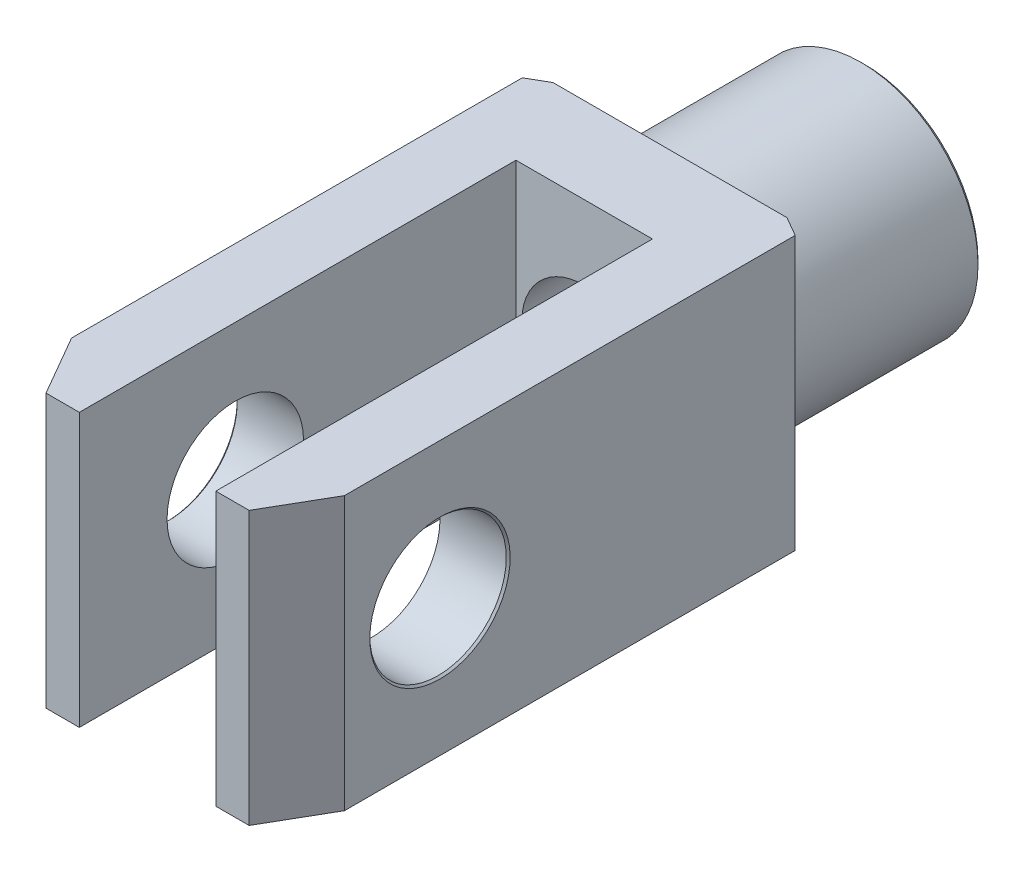
ISO-10303-21;
HEADER;
FILE_DESCRIPTION(('STEP AP214'),'2;1');
FILE_NAME('part.step','',(''),(''),'','','');
FILE_SCHEMA(('AUTOMOTIVE_DESIGN { 1 0 10303 214 1 1 1 1 }'));
ENDSEC;
DATA;
#1=APPLICATION_CONTEXT('core data for automotive mechanical design processes');
#2=APPLICATION_PROTOCOL_DEFINITION('international standard','automotive_design',2000,#1);
#3=PRODUCT_CONTEXT('',#1,'mechanical');
#4=PRODUCT('Part','Part','',(#3));
#5=PRODUCT_RELATED_PRODUCT_CATEGORY('part','',(#4));
#6=PRODUCT_DEFINITION_FORMATION('','',#4);
#7=PRODUCT_DEFINITION_CONTEXT('part definition',#1,'design');
#8=PRODUCT_DEFINITION('design','',#6,#7);
#9=PRODUCT_DEFINITION_SHAPE('','',#8);
#10=(LENGTH_UNIT() NAMED_UNIT(*) SI_UNIT(.MILLI.,.METRE.));
#11=(NAMED_UNIT(*) PLANE_ANGLE_UNIT() SI_UNIT($,.RADIAN.));
#12=(NAMED_UNIT(*) SI_UNIT($,.STERADIAN.) SOLID_ANGLE_UNIT());
#13=UNCERTAINTY_MEASURE_WITH_UNIT(LENGTH_MEASURE(1.E-05),#10,'distance_accuracy_value','');
#14=(GEOMETRIC_REPRESENTATION_CONTEXT(3) GLOBAL_UNCERTAINTY_ASSIGNED_CONTEXT((#13)) GLOBAL_UNIT_ASSIGNED_CONTEXT((#10,
#11,#12)) REPRESENTATION_CONTEXT('',''));
#15=CARTESIAN_POINT('',(0.,0.,0.));
#16=DIRECTION('',(0.,0.,1.));
#17=DIRECTION('',(1.,0.,0.));
#18=AXIS2_PLACEMENT_3D('',#15,#16,#17);
#19=CARTESIAN_POINT('',(0.,0.,50.));
#20=DIRECTION('',(0.,0.,1.));
#21=DIRECTION('',(1.,0.,0.));
#22=AXIS2_PLACEMENT_3D('',#19,#20,#21);
#23=PLANE('',#22);
#24=DIRECTION('',(1.,0.,0.));
#25=VECTOR('',#24,1.);
#26=CARTESIAN_POINT('',(-35.,-35.,50.));
#27=LINE('',#26,#25);
#28=CARTESIAN_POINT('',(-30.,-35.,50.));
#29=VERTEX_POINT('',#28);
#30=CARTESIAN_POINT('',(29.9999999999999,-35.,50.));
#31=VERTEX_POINT('',#30);
#32=EDGE_CURVE('E173',#29,#31,#27,.T.);
#33=ORIENTED_EDGE('',*,*,#32,.F.);
#34=DIRECTION('',(0.,1.,0.));
#35=VECTOR('',#34,1.);
#36=CARTESIAN_POINT('',(-30.,0.,50.));
#37=LINE('',#36,#35);
#38=CARTESIAN_POINT('',(-30.,0.,50.));
#39=VERTEX_POINT('',#38);
#40=EDGE_CURVE('E60',#29,#39,#37,.T.);
#41=ORIENTED_EDGE('',*,*,#40,.T.);
#42=CARTESIAN_POINT('',(0.,0.,50.));
#43=DIRECTION('',(0.,0.,1.));
#44=DIRECTION('',(1.,0.,0.));
#45=AXIS2_PLACEMENT_3D('',#42,#43,#44);
#46=CIRCLE('',#45,30.);
#47=CARTESIAN_POINT('',(30.,0.,50.));
#48=VERTEX_POINT('',#47);
#49=EDGE_CURVE('E200',#39,#48,#46,.T.);
#50=ORIENTED_EDGE('',*,*,#49,.T.);
#51=DIRECTION('',(0.,-1.,0.));
#52=VECTOR('',#51,1.);
#53=CARTESIAN_POINT('',(30.,0.,50.));
#54=LINE('',#53,#52);
#55=EDGE_CURVE('E257',#48,#31,#54,.T.);
#56=ORIENTED_EDGE('',*,*,#55,.T.);
#57=EDGE_LOOP('',(#33,#41,#50,#56));
#58=FACE_BOUND('',#57,.T.);
#59=ADVANCED_FACE('F38',(#58),#23,.F.);
#60=CARTESIAN_POINT('',(0.,0.,184.));
#61=DIRECTION('',(0.,0.,1.));
#62=DIRECTION('',(1.,0.,0.));
#63=AXIS2_PLACEMENT_3D('',#60,#61,#62);
#64=PLANE('',#63);
#65=DIRECTION('',(-1.,0.,0.));
#66=VECTOR('',#65,1.);
#67=CARTESIAN_POINT('',(-35.,35.,184.));
#68=LINE('',#67,#66);
#69=CARTESIAN_POINT('',(-17.5,35.,184.));
#70=VERTEX_POINT('',#69);
#71=CARTESIAN_POINT('',(-26.0510708275608,35.,184.));
#72=VERTEX_POINT('',#71);
#73=EDGE_CURVE('E180',#70,#72,#68,.T.);
#74=ORIENTED_EDGE('',*,*,#73,.T.);
#75=DIRECTION('',(0.,-1.,0.));
#76=VECTOR('',#75,1.);
#77=CARTESIAN_POINT('',(-26.0510708275608,-35.,184.));
#78=LINE('',#77,#76);
#79=CARTESIAN_POINT('',(-26.0510708275608,-35.,184.));
#80=VERTEX_POINT('',#79);
#81=EDGE_CURVE('E217',#72,#80,#78,.T.);
#82=ORIENTED_EDGE('',*,*,#81,.T.);
#83=DIRECTION('',(1.,0.,0.));
#84=VECTOR('',#83,1.);
#85=CARTESIAN_POINT('',(-35.,-35.,184.));
#86=LINE('',#85,#84);
#87=CARTESIAN_POINT('',(-17.5,-35.,184.));
#88=VERTEX_POINT('',#87);
#89=EDGE_CURVE('E178',#80,#88,#86,.T.);
#90=ORIENTED_EDGE('',*,*,#89,.T.);
#91=DIRECTION('',(0.,-1.,0.));
#92=VECTOR('',#91,1.);
#93=CARTESIAN_POINT('',(-17.5,35.,184.));
#94=LINE('',#93,#92);
#95=EDGE_CURVE('E141',#70,#88,#94,.T.);
#96=ORIENTED_EDGE('',*,*,#95,.F.);
#97=EDGE_LOOP('',(#74,#82,#90,#96));
#98=FACE_BOUND('',#97,.T.);
#99=ADVANCED_FACE('F300',(#98),#64,.T.);
#100=CARTESIAN_POINT('',(0.,0.,50.));
#101=DIRECTION('',(0.,0.,-1.));
#102=DIRECTION('',(-1.,0.,0.));
#103=AXIS2_PLACEMENT_3D('',#100,#101,#102);
#104=CYLINDRICAL_SURFACE('',#103,30.);
#105=CARTESIAN_POINT('',(0.,0.,1.00000000000003));
#106=DIRECTION('',(0.,0.,1.));
#107=DIRECTION('',(1.,0.,0.));
#108=AXIS2_PLACEMENT_3D('',#105,#106,#107);
#109=CIRCLE('',#108,30.);
#110=CARTESIAN_POINT('',(30.,0.,1.00000000000003));
#111=VERTEX_POINT('',#110);
#112=EDGE_CURVE('E238',#111,#111,#109,.T.);
#113=ORIENTED_EDGE('',*,*,#112,.T.);
#114=EDGE_LOOP('',(#113));
#115=FACE_BOUND('',#114,.T.);
#116=EDGE_CURVE('E201',#48,#39,#46,.T.);
#117=ORIENTED_EDGE('',*,*,#116,.F.);
#118=ORIENTED_EDGE('',*,*,#49,.F.);
#119=EDGE_LOOP('',(#117,#118));
#120=FACE_BOUND('',#119,.T.);
#121=ADVANCED_FACE('F323',(#115,#120),#104,.T.);
#122=CARTESIAN_POINT('',(0.,0.,0.));
#123=DIRECTION('',(0.,0.,1.));
#124=DIRECTION('',(1.,0.,0.));
#125=AXIS2_PLACEMENT_3D('',#122,#123,#124);
#126=PLANE('',#125);
#127=CARTESIAN_POINT('',(0.,0.,0.));
#128=DIRECTION('',(0.,0.,1.));
#129=DIRECTION('',(1.,0.,0.));
#130=AXIS2_PLACEMENT_3D('',#127,#128,#129);
#131=CIRCLE('',#130,18.);
#132=CARTESIAN_POINT('',(18.,0.,0.));
#133=VERTEX_POINT('',#132);
#134=EDGE_CURVE('E247',#133,#133,#131,.T.);
#135=ORIENTED_EDGE('',*,*,#134,.T.);
#136=EDGE_LOOP('',(#135));
#137=FACE_BOUND('',#136,.T.);
#138=CARTESIAN_POINT('',(0.,0.,0.));
#139=DIRECTION('',(0.,0.,1.));
#140=DIRECTION('',(1.,0.,0.));
#141=AXIS2_PLACEMENT_3D('',#138,#139,#140);
#142=CIRCLE('',#141,28.9999999999999);
#143=CARTESIAN_POINT('',(28.9999999999999,0.,0.));
#144=VERTEX_POINT('',#143);
#145=EDGE_CURVE('E241',#144,#144,#142,.F.);
#146=ORIENTED_EDGE('',*,*,#145,.T.);
#147=EDGE_LOOP('',(#146));
#148=FACE_BOUND('',#147,.T.);
#149=ADVANCED_FACE('F327',(#137,#148),#126,.F.);
#150=ORIENTED_EDGE('',*,*,#116,.T.);
#151=DIRECTION('',(0.,1.,0.));
#152=VECTOR('',#151,1.);
#153=CARTESIAN_POINT('',(-30.,0.,50.));
#154=LINE('',#153,#152);
#155=CARTESIAN_POINT('',(-30.,35.,50.));
#156=VERTEX_POINT('',#155);
#157=EDGE_CURVE('E261',#39,#156,#154,.T.);
#158=ORIENTED_EDGE('',*,*,#157,.T.);
#159=DIRECTION('',(-1.,0.,0.));
#160=VECTOR('',#159,1.);
#161=CARTESIAN_POINT('',(-35.,35.,50.));
#162=LINE('',#161,#160);
#163=CARTESIAN_POINT('',(30.,35.,50.));
#164=VERTEX_POINT('',#163);
#165=EDGE_CURVE('E187',#164,#156,#162,.T.);
#166=ORIENTED_EDGE('',*,*,#165,.F.);
#167=DIRECTION('',(0.,-1.,0.));
#168=VECTOR('',#167,1.);
#169=CARTESIAN_POINT('',(30.,0.,50.));
#170=LINE('',#169,#168);
#171=EDGE_CURVE('E259',#164,#48,#170,.T.);
#172=ORIENTED_EDGE('',*,*,#171,.T.);
#173=EDGE_LOOP('',(#150,#158,#166,#172));
#174=FACE_BOUND('',#173,.T.);
#175=ADVANCED_FACE('F319',(#174),#23,.F.);
#176=CARTESIAN_POINT('',(-35.,35.,184.));
#177=DIRECTION('',(1.,0.,0.));
#178=DIRECTION('',(0.,1.,0.));
#179=AXIS2_PLACEMENT_3D('',#176,#177,#178);
#180=PLANE('',#179);
#181=CARTESIAN_POINT('',(-35.,0.,144.));
#182=DIRECTION('',(1.,0.,0.));
#183=DIRECTION('',(0.,1.,0.));
#184=AXIS2_PLACEMENT_3D('',#181,#182,#183);
#185=CIRCLE('',#184,18.);
#186=CARTESIAN_POINT('',(-35.,18.,144.));
#187=VERTEX_POINT('',#186);
#188=EDGE_CURVE('E222',#187,#187,#185,.T.);
#189=ORIENTED_EDGE('',*,*,#188,.T.);
#190=EDGE_LOOP('',(#189));
#191=FACE_BOUND('',#190,.T.);
#192=DIRECTION('',(0.,0.,-1.));
#193=VECTOR('',#192,1.);
#194=CARTESIAN_POINT('',(-35.,35.,184.));
#195=LINE('',#194,#193);
#196=CARTESIAN_POINT('',(-35.,35.,168.5));
#197=VERTEX_POINT('',#196);
#198=CARTESIAN_POINT('',(-35.,35.,52.8867513459481));
#199=VERTEX_POINT('',#198);
#200=EDGE_CURVE('E184',#197,#199,#195,.T.);
#201=ORIENTED_EDGE('',*,*,#200,.T.);
#202=DIRECTION('',(0.,-1.,0.));
#203=VECTOR('',#202,1.);
#204=CARTESIAN_POINT('',(-35.,35.,52.8867513459481));
#205=LINE('',#204,#203);
#206=CARTESIAN_POINT('',(-35.,-35.,52.8867513459481));
#207=VERTEX_POINT('',#206);
#208=EDGE_CURVE('E250',#199,#207,#205,.T.);
#209=ORIENTED_EDGE('',*,*,#208,.T.);
#210=DIRECTION('',(0.,0.,-1.));
#211=VECTOR('',#210,1.);
#212=CARTESIAN_POINT('',(-35.,-35.,184.));
#213=LINE('',#212,#211);
#214=CARTESIAN_POINT('',(-35.,-35.,168.5));
#215=VERTEX_POINT('',#214);
#216=EDGE_CURVE('E198',#215,#207,#213,.T.);
#217=ORIENTED_EDGE('',*,*,#216,.F.);
#218=DIRECTION('',(0.,1.,0.));
#219=VECTOR('',#218,1.);
#220=CARTESIAN_POINT('',(-35.,35.,168.5));
#221=LINE('',#220,#219);
#222=EDGE_CURVE('E220',#215,#197,#221,.T.);
#223=ORIENTED_EDGE('',*,*,#222,.T.);
#224=EDGE_LOOP('',(#201,#209,#217,#223));
#225=FACE_BOUND('',#224,.T.);
#226=ADVANCED_FACE('F274',(#191,#225),#180,.F.);
#227=CARTESIAN_POINT('',(-35.,-35.,184.));
#228=DIRECTION('',(0.,1.,0.));
#229=DIRECTION('',(0.,0.,1.));
#230=AXIS2_PLACEMENT_3D('',#227,#228,#229);
#231=PLANE('',#230);
#232=ORIENTED_EDGE('',*,*,#216,.T.);
#233=DIRECTION('',(-0.866025403784441,0.,0.499999999999995));
#234=VECTOR('',#233,1.);
#235=CARTESIAN_POINT('',(-35.,-35.,52.8867513459481));
#236=LINE('',#235,#234);
#237=EDGE_CURVE('E255',#207,#29,#236,.F.);
#238=ORIENTED_EDGE('',*,*,#237,.T.);
#239=ORIENTED_EDGE('',*,*,#32,.T.);
#240=DIRECTION('',(-0.866025403784441,0.,-0.499999999999995));
#241=VECTOR('',#240,1.);
#242=CARTESIAN_POINT('',(35.,-35.,52.8867513459481));
#243=LINE('',#242,#241);
#244=CARTESIAN_POINT('',(35.,-35.,52.8867513459481));
#245=VERTEX_POINT('',#244);
#246=EDGE_CURVE('E253',#31,#245,#243,.F.);
#247=ORIENTED_EDGE('',*,*,#246,.T.);
#248=DIRECTION('',(0.,0.,-1.));
#249=VECTOR('',#248,1.);
#250=CARTESIAN_POINT('',(35.,-35.,184.));
#251=LINE('',#250,#249);
#252=CARTESIAN_POINT('',(35.,-35.,168.5));
#253=VERTEX_POINT('',#252);
#254=EDGE_CURVE('E195',#253,#245,#251,.T.);
#255=ORIENTED_EDGE('',*,*,#254,.F.);
#256=DIRECTION('',(-0.499999999999998,0.,0.86602540378444));
#257=VECTOR('',#256,1.);
#258=CARTESIAN_POINT('',(26.0510708275608,-35.,184.));
#259=LINE('',#258,#257);
#260=CARTESIAN_POINT('',(26.0510708275608,-35.,184.));
#261=VERTEX_POINT('',#260);
#262=EDGE_CURVE('E215',#253,#261,#259,.T.);
#263=ORIENTED_EDGE('',*,*,#262,.T.);
#264=CARTESIAN_POINT('',(17.5,-35.,184.));
#265=VERTEX_POINT('',#264);
#266=EDGE_CURVE('E181',#265,#261,#86,.T.);
#267=ORIENTED_EDGE('',*,*,#266,.F.);
#268=DIRECTION('',(0.,0.,1.));
#269=VECTOR('',#268,1.);
#270=CARTESIAN_POINT('',(17.5,-35.,72.));
#271=LINE('',#270,#269);
#272=CARTESIAN_POINT('',(17.5,-35.,72.));
#273=VERTEX_POINT('',#272);
#274=EDGE_CURVE('E145',#273,#265,#271,.T.);
#275=ORIENTED_EDGE('',*,*,#274,.F.);
#276=DIRECTION('',(1.,0.,0.));
#277=VECTOR('',#276,1.);
#278=CARTESIAN_POINT('',(-17.5,-35.,72.));
#279=LINE('',#278,#277);
#280=CARTESIAN_POINT('',(-17.5,-35.,72.));
#281=VERTEX_POINT('',#280);
#282=EDGE_CURVE('E152',#281,#273,#279,.T.);
#283=ORIENTED_EDGE('',*,*,#282,.F.);
#284=DIRECTION('',(0.,0.,1.));
#285=VECTOR('',#284,1.);
#286=CARTESIAN_POINT('',(-17.5,-35.,72.));
#287=LINE('',#286,#285);
#288=EDGE_CURVE('E135',#281,#88,#287,.T.);
#289=ORIENTED_EDGE('',*,*,#288,.T.);
#290=ORIENTED_EDGE('',*,*,#89,.F.);
#291=DIRECTION('',(-0.499999999999998,0.,-0.86602540378444));
#292=VECTOR('',#291,1.);
#293=CARTESIAN_POINT('',(-26.0510708275608,-35.,184.));
#294=LINE('',#293,#292);
#295=EDGE_CURVE('E213',#80,#215,#294,.T.);
#296=ORIENTED_EDGE('',*,*,#295,.T.);
#297=EDGE_LOOP('',(#232,#238,#239,#247,#255,#263,#267,#275,#283,#289,#290,#296));
#298=FACE_BOUND('',#297,.T.);
#299=ADVANCED_FACE('F159',(#298),#231,.F.);
#300=CARTESIAN_POINT('',(35.,35.,184.));
#301=DIRECTION('',(-1.,0.,0.));
#302=DIRECTION('',(0.,-1.,0.));
#303=AXIS2_PLACEMENT_3D('',#300,#301,#302);
#304=PLANE('',#303);
#305=CARTESIAN_POINT('',(35.,0.,144.));
#306=DIRECTION('',(-1.,0.,0.));
#307=DIRECTION('',(0.,-1.,0.));
#308=AXIS2_PLACEMENT_3D('',#305,#306,#307);
#309=CIRCLE('',#308,18.0000000000001);
#310=CARTESIAN_POINT('',(35.,-18.0000000000001,144.));
#311=VERTEX_POINT('',#310);
#312=EDGE_CURVE('E235',#311,#311,#309,.T.);
#313=ORIENTED_EDGE('',*,*,#312,.T.);
#314=EDGE_LOOP('',(#313));
#315=FACE_BOUND('',#314,.T.);
#316=ORIENTED_EDGE('',*,*,#254,.T.);
#317=DIRECTION('',(0.,1.,0.));
#318=VECTOR('',#317,1.);
#319=CARTESIAN_POINT('',(35.,35.,52.8867513459481));
#320=LINE('',#319,#318);
#321=CARTESIAN_POINT('',(35.,35.,52.8867513459481));
#322=VERTEX_POINT('',#321);
#323=EDGE_CURVE('E11',#245,#322,#320,.T.);
#324=ORIENTED_EDGE('',*,*,#323,.T.);
#325=DIRECTION('',(0.,0.,-1.));
#326=VECTOR('',#325,1.);
#327=CARTESIAN_POINT('',(35.,35.,184.));
#328=LINE('',#327,#326);
#329=CARTESIAN_POINT('',(35.,35.,168.5));
#330=VERTEX_POINT('',#329);
#331=EDGE_CURVE('E192',#330,#322,#328,.T.);
#332=ORIENTED_EDGE('',*,*,#331,.F.);
#333=DIRECTION('',(0.,-1.,0.));
#334=VECTOR('',#333,1.);
#335=CARTESIAN_POINT('',(35.,-35.,168.5));
#336=LINE('',#335,#334);
#337=EDGE_CURVE('E211',#330,#253,#336,.T.);
#338=ORIENTED_EDGE('',*,*,#337,.T.);
#339=EDGE_LOOP('',(#316,#324,#332,#338));
#340=FACE_BOUND('',#339,.T.);
#341=ADVANCED_FACE('F284',(#315,#340),#304,.F.);
#342=CARTESIAN_POINT('',(-35.,35.,184.));
#343=DIRECTION('',(0.,-1.,0.));
#344=DIRECTION('',(0.,0.,-1.));
#345=AXIS2_PLACEMENT_3D('',#342,#343,#344);
#346=PLANE('',#345);
#347=ORIENTED_EDGE('',*,*,#165,.T.);
#348=DIRECTION('',(0.866025403784441,0.,-0.499999999999995));
#349=VECTOR('',#348,1.);
#350=CARTESIAN_POINT('',(-35.,35.,52.8867513459481));
#351=LINE('',#350,#349);
#352=EDGE_CURVE('E46',#156,#199,#351,.F.);
#353=ORIENTED_EDGE('',*,*,#352,.T.);
#354=ORIENTED_EDGE('',*,*,#200,.F.);
#355=DIRECTION('',(0.499999999999998,0.,0.86602540378444));
#356=VECTOR('',#355,1.);
#357=CARTESIAN_POINT('',(-26.0510708275608,35.,184.));
#358=LINE('',#357,#356);
#359=EDGE_CURVE('E207',#197,#72,#358,.T.);
#360=ORIENTED_EDGE('',*,*,#359,.T.);
#361=ORIENTED_EDGE('',*,*,#73,.F.);
#362=DIRECTION('',(0.,0.,1.));
#363=VECTOR('',#362,1.);
#364=CARTESIAN_POINT('',(-17.5,35.,72.));
#365=LINE('',#364,#363);
#366=CARTESIAN_POINT('',(-17.5,35.,72.));
#367=VERTEX_POINT('',#366);
#368=EDGE_CURVE('E171',#367,#70,#365,.T.);
#369=ORIENTED_EDGE('',*,*,#368,.F.);
#370=DIRECTION('',(-1.,0.,0.));
#371=VECTOR('',#370,1.);
#372=CARTESIAN_POINT('',(-17.5,35.,72.));
#373=LINE('',#372,#371);
#374=CARTESIAN_POINT('',(17.5,35.,72.));
#375=VERTEX_POINT('',#374);
#376=EDGE_CURVE('E146',#375,#367,#373,.T.);
#377=ORIENTED_EDGE('',*,*,#376,.F.);
#378=DIRECTION('',(0.,0.,1.));
#379=VECTOR('',#378,1.);
#380=CARTESIAN_POINT('',(17.5,35.,72.));
#381=LINE('',#380,#379);
#382=CARTESIAN_POINT('',(17.5,35.,184.));
#383=VERTEX_POINT('',#382);
#384=EDGE_CURVE('E174',#375,#383,#381,.T.);
#385=ORIENTED_EDGE('',*,*,#384,.T.);
#386=CARTESIAN_POINT('',(26.0510708275608,35.,184.));
#387=VERTEX_POINT('',#386);
#388=EDGE_CURVE('E182',#387,#383,#68,.T.);
#389=ORIENTED_EDGE('',*,*,#388,.F.);
#390=DIRECTION('',(0.499999999999998,0.,-0.86602540378444));
#391=VECTOR('',#390,1.);
#392=CARTESIAN_POINT('',(26.0510708275608,35.,184.));
#393=LINE('',#392,#391);
#394=EDGE_CURVE('E209',#387,#330,#393,.T.);
#395=ORIENTED_EDGE('',*,*,#394,.T.);
#396=ORIENTED_EDGE('',*,*,#331,.T.);
#397=DIRECTION('',(0.866025403784441,0.,0.499999999999995));
#398=VECTOR('',#397,1.);
#399=CARTESIAN_POINT('',(35.,35.,52.8867513459481));
#400=LINE('',#399,#398);
#401=EDGE_CURVE('E53',#322,#164,#400,.F.);
#402=ORIENTED_EDGE('',*,*,#401,.T.);
#403=EDGE_LOOP('',(#347,#353,#354,#360,#361,#369,#377,#385,#389,#395,#396,#402));
#404=FACE_BOUND('',#403,.T.);
#405=ADVANCED_FACE('F267',(#404),#346,.F.);
#406=ORIENTED_EDGE('',*,*,#266,.T.);
#407=DIRECTION('',(0.,1.,0.));
#408=VECTOR('',#407,1.);
#409=CARTESIAN_POINT('',(26.0510708275608,35.,184.));
#410=LINE('',#409,#408);
#411=EDGE_CURVE('E204',#261,#387,#410,.T.);
#412=ORIENTED_EDGE('',*,*,#411,.T.);
#413=ORIENTED_EDGE('',*,*,#388,.T.);
#414=DIRECTION('',(0.,1.,0.));
#415=VECTOR('',#414,1.);
#416=CARTESIAN_POINT('',(17.5,35.,184.));
#417=LINE('',#416,#415);
#418=EDGE_CURVE('E156',#265,#383,#417,.T.);
#419=ORIENTED_EDGE('',*,*,#418,.F.);
#420=EDGE_LOOP('',(#406,#412,#413,#419));
#421=FACE_BOUND('',#420,.T.);
#422=ADVANCED_FACE('F293',(#421),#64,.T.);
#423=CARTESIAN_POINT('',(-17.5,35.,72.));
#424=DIRECTION('',(-1.,0.,0.));
#425=DIRECTION('',(0.,-1.,0.));
#426=AXIS2_PLACEMENT_3D('',#423,#424,#425);
#427=PLANE('',#426);
#428=CARTESIAN_POINT('',(-17.5,0.,144.));
#429=DIRECTION('',(-1.,0.,0.));
#430=DIRECTION('',(0.,-1.,0.));
#431=AXIS2_PLACEMENT_3D('',#428,#429,#430);
#432=CIRCLE('',#431,17.5);
#433=CARTESIAN_POINT('',(-17.5,-17.5,144.));
#434=VERTEX_POINT('',#433);
#435=EDGE_CURVE('E226',#434,#434,#432,.T.);
#436=ORIENTED_EDGE('',*,*,#435,.T.);
#437=EDGE_LOOP('',(#436));
#438=FACE_BOUND('',#437,.T.);
#439=ORIENTED_EDGE('',*,*,#95,.T.);
#440=ORIENTED_EDGE('',*,*,#288,.F.);
#441=DIRECTION('',(0.,-1.,0.));
#442=VECTOR('',#441,1.);
#443=CARTESIAN_POINT('',(-17.5,35.,72.));
#444=LINE('',#443,#442);
#445=EDGE_CURVE('E138',#367,#281,#444,.T.);
#446=ORIENTED_EDGE('',*,*,#445,.F.);
#447=ORIENTED_EDGE('',*,*,#368,.T.);
#448=EDGE_LOOP('',(#439,#440,#446,#447));
#449=FACE_BOUND('',#448,.T.);
#450=ADVANCED_FACE('F137',(#438,#449),#427,.F.);
#451=CARTESIAN_POINT('',(17.5,35.,72.));
#452=DIRECTION('',(1.,0.,0.));
#453=DIRECTION('',(0.,1.,0.));
#454=AXIS2_PLACEMENT_3D('',#451,#452,#453);
#455=PLANE('',#454);
#456=CARTESIAN_POINT('',(17.5,0.,144.));
#457=DIRECTION('',(1.,0.,0.));
#458=DIRECTION('',(0.,1.,0.));
#459=AXIS2_PLACEMENT_3D('',#456,#457,#458);
#460=CIRCLE('',#459,17.5);
#461=CARTESIAN_POINT('',(17.5,17.5,144.));
#462=VERTEX_POINT('',#461);
#463=EDGE_CURVE('E223',#462,#462,#460,.T.);
#464=ORIENTED_EDGE('',*,*,#463,.T.);
#465=EDGE_LOOP('',(#464));
#466=FACE_BOUND('',#465,.T.);
#467=ORIENTED_EDGE('',*,*,#418,.T.);
#468=ORIENTED_EDGE('',*,*,#384,.F.);
#469=DIRECTION('',(0.,1.,0.));
#470=VECTOR('',#469,1.);
#471=CARTESIAN_POINT('',(17.5,35.,72.));
#472=LINE('',#471,#470);
#473=EDGE_CURVE('E161',#273,#375,#472,.T.);
#474=ORIENTED_EDGE('',*,*,#473,.F.);
#475=ORIENTED_EDGE('',*,*,#274,.T.);
#476=EDGE_LOOP('',(#467,#468,#474,#475));
#477=FACE_BOUND('',#476,.T.);
#478=ADVANCED_FACE('F296',(#466,#477),#455,.F.);
#479=CARTESIAN_POINT('',(0.,0.,72.));
#480=DIRECTION('',(0.,0.,1.));
#481=DIRECTION('',(1.,0.,0.));
#482=AXIS2_PLACEMENT_3D('',#479,#480,#481);
#483=PLANE('',#482);
#484=CARTESIAN_POINT('',(0.,0.,72.));
#485=DIRECTION('',(0.,0.,-1.));
#486=DIRECTION('',(-1.,0.,0.));
#487=AXIS2_PLACEMENT_3D('',#484,#485,#486);
#488=CIRCLE('',#487,16.);
#489=CARTESIAN_POINT('',(-16.,0.,72.));
#490=VERTEX_POINT('',#489);
#491=EDGE_CURVE('E168',#490,#490,#488,.T.);
#492=ORIENTED_EDGE('',*,*,#491,.T.);
#493=EDGE_LOOP('',(#492));
#494=FACE_BOUND('',#493,.T.);
#495=ORIENTED_EDGE('',*,*,#445,.T.);
#496=ORIENTED_EDGE('',*,*,#282,.T.);
#497=ORIENTED_EDGE('',*,*,#473,.T.);
#498=ORIENTED_EDGE('',*,*,#376,.T.);
#499=EDGE_LOOP('',(#495,#496,#497,#498));
#500=FACE_BOUND('',#499,.T.);
#501=ADVANCED_FACE('F150',(#494,#500),#483,.T.);
#502=CARTESIAN_POINT('',(0.,0.,72.));
#503=DIRECTION('',(0.,0.,-1.));
#504=DIRECTION('',(-1.,0.,0.));
#505=AXIS2_PLACEMENT_3D('',#502,#503,#504);
#506=CYLINDRICAL_SURFACE('',#505,16.);
#507=CARTESIAN_POINT('',(0.,0.,2.00000000000002));
#508=DIRECTION('',(0.,0.,1.));
#509=DIRECTION('',(1.,0.,0.));
#510=AXIS2_PLACEMENT_3D('',#507,#508,#509);
#511=CIRCLE('',#510,16.);
#512=CARTESIAN_POINT('',(16.,0.,2.00000000000002));
#513=VERTEX_POINT('',#512);
#514=EDGE_CURVE('E244',#513,#513,#511,.F.);
#515=ORIENTED_EDGE('',*,*,#514,.T.);
#516=EDGE_LOOP('',(#515));
#517=FACE_BOUND('',#516,.T.);
#518=ORIENTED_EDGE('',*,*,#491,.F.);
#519=EDGE_LOOP('',(#518));
#520=FACE_BOUND('',#519,.T.);
#521=ADVANCED_FACE('F314',(#517,#520),#506,.F.);
#522=CARTESIAN_POINT('',(26.0510708275608,0.,184.));
#523=DIRECTION('',(0.86602540378444,0.,0.499999999999998));
#524=DIRECTION('',(0.,-1.,0.));
#525=AXIS2_PLACEMENT_3D('',#522,#523,#524);
#526=PLANE('',#525);
#527=ORIENTED_EDGE('',*,*,#262,.F.);
#528=ORIENTED_EDGE('',*,*,#337,.F.);
#529=ORIENTED_EDGE('',*,*,#394,.F.);
#530=ORIENTED_EDGE('',*,*,#411,.F.);
#531=EDGE_LOOP('',(#527,#528,#529,#530));
#532=FACE_BOUND('',#531,.T.);
#533=ADVANCED_FACE('F288',(#532),#526,.T.);
#534=CARTESIAN_POINT('',(-26.0510708275608,0.,184.));
#535=DIRECTION('',(-0.86602540378444,0.,0.499999999999998));
#536=DIRECTION('',(0.,1.,0.));
#537=AXIS2_PLACEMENT_3D('',#534,#535,#536);
#538=PLANE('',#537);
#539=ORIENTED_EDGE('',*,*,#359,.F.);
#540=ORIENTED_EDGE('',*,*,#222,.F.);
#541=ORIENTED_EDGE('',*,*,#295,.F.);
#542=ORIENTED_EDGE('',*,*,#81,.F.);
#543=EDGE_LOOP('',(#539,#540,#541,#542));
#544=FACE_BOUND('',#543,.T.);
#545=ADVANCED_FACE('F303',(#544),#538,.T.);
#546=CARTESIAN_POINT('',(-35.,0.,144.));
#547=DIRECTION('',(1.,0.,0.));
#548=DIRECTION('',(0.,1.,0.));
#549=AXIS2_PLACEMENT_3D('',#546,#547,#548);
#550=CYLINDRICAL_SURFACE('',#549,17.5);
#551=CARTESIAN_POINT('',(34.4999999999999,0.,144.));
#552=DIRECTION('',(-1.,0.,0.));
#553=DIRECTION('',(0.,-1.,0.));
#554=AXIS2_PLACEMENT_3D('',#551,#552,#553);
#555=CIRCLE('',#554,17.5);
#556=CARTESIAN_POINT('',(34.4999999999999,-17.5,144.));
#557=VERTEX_POINT('',#556);
#558=EDGE_CURVE('E232',#557,#557,#555,.F.);
#559=ORIENTED_EDGE('',*,*,#558,.T.);
#560=EDGE_LOOP('',(#559));
#561=FACE_BOUND('',#560,.T.);
#562=ORIENTED_EDGE('',*,*,#463,.F.);
#563=EDGE_LOOP('',(#562));
#564=FACE_BOUND('',#563,.T.);
#565=ADVANCED_FACE('F305',(#561,#564),#550,.F.);
#566=CARTESIAN_POINT('',(-34.5,0.,144.));
#567=DIRECTION('',(1.,0.,0.));
#568=DIRECTION('',(0.,1.,0.));
#569=AXIS2_PLACEMENT_3D('',#566,#567,#568);
#570=CIRCLE('',#569,17.5);
#571=CARTESIAN_POINT('',(-34.5,17.5,144.));
#572=VERTEX_POINT('',#571);
#573=EDGE_CURVE('E229',#572,#572,#570,.F.);
#574=ORIENTED_EDGE('',*,*,#573,.T.);
#575=EDGE_LOOP('',(#574));
#576=FACE_BOUND('',#575,.T.);
#577=ORIENTED_EDGE('',*,*,#435,.F.);
#578=EDGE_LOOP('',(#577));
#579=FACE_BOUND('',#578,.T.);
#580=ADVANCED_FACE('F311',(#576,#579),#550,.F.);
#581=CARTESIAN_POINT('',(-35.,0.,144.));
#582=DIRECTION('',(-1.,0.,0.));
#583=DIRECTION('',(0.,-1.,0.));
#584=AXIS2_PLACEMENT_3D('',#581,#582,#583);
#585=CONICAL_SURFACE('',#584,18.,0.785398163397466);
#586=ORIENTED_EDGE('',*,*,#573,.F.);
#587=EDGE_LOOP('',(#586));
#588=FACE_BOUND('',#587,.T.);
#589=ORIENTED_EDGE('',*,*,#188,.F.);
#590=EDGE_LOOP('',(#589));
#591=FACE_BOUND('',#590,.T.);
#592=ADVANCED_FACE('F367',(#588,#591),#585,.F.);
#593=CARTESIAN_POINT('',(34.4999999999999,0.,144.));
#594=DIRECTION('',(1.,0.,0.));
#595=DIRECTION('',(0.,1.,0.));
#596=AXIS2_PLACEMENT_3D('',#593,#594,#595);
#597=CONICAL_SURFACE('',#596,17.5,0.785398163397424);
#598=ORIENTED_EDGE('',*,*,#312,.F.);
#599=EDGE_LOOP('',(#598));
#600=FACE_BOUND('',#599,.T.);
#601=ORIENTED_EDGE('',*,*,#558,.F.);
#602=EDGE_LOOP('',(#601));
#603=FACE_BOUND('',#602,.T.);
#604=ADVANCED_FACE('F372',(#600,#603),#597,.F.);
#605=CARTESIAN_POINT('',(0.,0.,1.00000000000003));
#606=DIRECTION('',(0.,0.,1.));
#607=DIRECTION('',(1.,0.,0.));
#608=AXIS2_PLACEMENT_3D('',#605,#606,#607);
#609=CONICAL_SURFACE('',#608,30.,0.78539816339746);
#610=ORIENTED_EDGE('',*,*,#145,.F.);
#611=EDGE_LOOP('',(#610));
#612=FACE_BOUND('',#611,.T.);
#613=ORIENTED_EDGE('',*,*,#112,.F.);
#614=EDGE_LOOP('',(#613));
#615=FACE_BOUND('',#614,.T.);
#616=ADVANCED_FACE('F387',(#612,#615),#609,.T.);
#617=CARTESIAN_POINT('',(0.,0.,2.00000000000002));
#618=DIRECTION('',(0.,0.,-1.));
#619=DIRECTION('',(-1.,0.,0.));
#620=AXIS2_PLACEMENT_3D('',#617,#618,#619);
#621=CONICAL_SURFACE('',#620,16.,0.785398163397455);
#622=ORIENTED_EDGE('',*,*,#134,.F.);
#623=EDGE_LOOP('',(#622));
#624=FACE_BOUND('',#623,.T.);
#625=ORIENTED_EDGE('',*,*,#514,.F.);
#626=EDGE_LOOP('',(#625));
#627=FACE_BOUND('',#626,.T.);
#628=ADVANCED_FACE('F393',(#624,#627),#621,.F.);
#629=CARTESIAN_POINT('',(-35.,35.,52.8867513459481));
#630=DIRECTION('',(0.499999999999995,0.,0.866025403784441));
#631=DIRECTION('',(0.,-1.,0.));
#632=AXIS2_PLACEMENT_3D('',#629,#630,#631);
#633=PLANE('',#632);
#634=ORIENTED_EDGE('',*,*,#157,.F.);
#635=ORIENTED_EDGE('',*,*,#40,.F.);
#636=ORIENTED_EDGE('',*,*,#237,.F.);
#637=ORIENTED_EDGE('',*,*,#208,.F.);
#638=ORIENTED_EDGE('',*,*,#352,.F.);
#639=EDGE_LOOP('',(#634,#635,#636,#637,#638));
#640=FACE_BOUND('',#639,.T.);
#641=ADVANCED_FACE('F277',(#640),#633,.F.);
#642=CARTESIAN_POINT('',(35.,35.,52.8867513459481));
#643=DIRECTION('',(-0.499999999999995,0.,0.866025403784441));
#644=DIRECTION('',(0.,1.,0.));
#645=AXIS2_PLACEMENT_3D('',#642,#643,#644);
#646=PLANE('',#645);
#647=ORIENTED_EDGE('',*,*,#55,.F.);
#648=ORIENTED_EDGE('',*,*,#171,.F.);
#649=ORIENTED_EDGE('',*,*,#401,.F.);
#650=ORIENTED_EDGE('',*,*,#323,.F.);
#651=ORIENTED_EDGE('',*,*,#246,.F.);
#652=EDGE_LOOP('',(#647,#648,#649,#650,#651));
#653=FACE_BOUND('',#652,.T.);
#654=ADVANCED_FACE('F40',(#653),#646,.F.);
#655=CLOSED_SHELL('',(#59,#99,#121,#149,#175,#226,#299,#341,#405,#422,#450,#478,#501,#521,#533,
#545,#565,#580,#592,#604,#616,#628,#641,#654));
#656=MANIFOLD_SOLID_BREP('B2',#655);
#657=ADVANCED_BREP_SHAPE_REPRESENTATION('',(#18,#656),#14);
#658=SHAPE_DEFINITION_REPRESENTATION(#9,#657);
ENDSEC;
END-ISO-10303-21;
